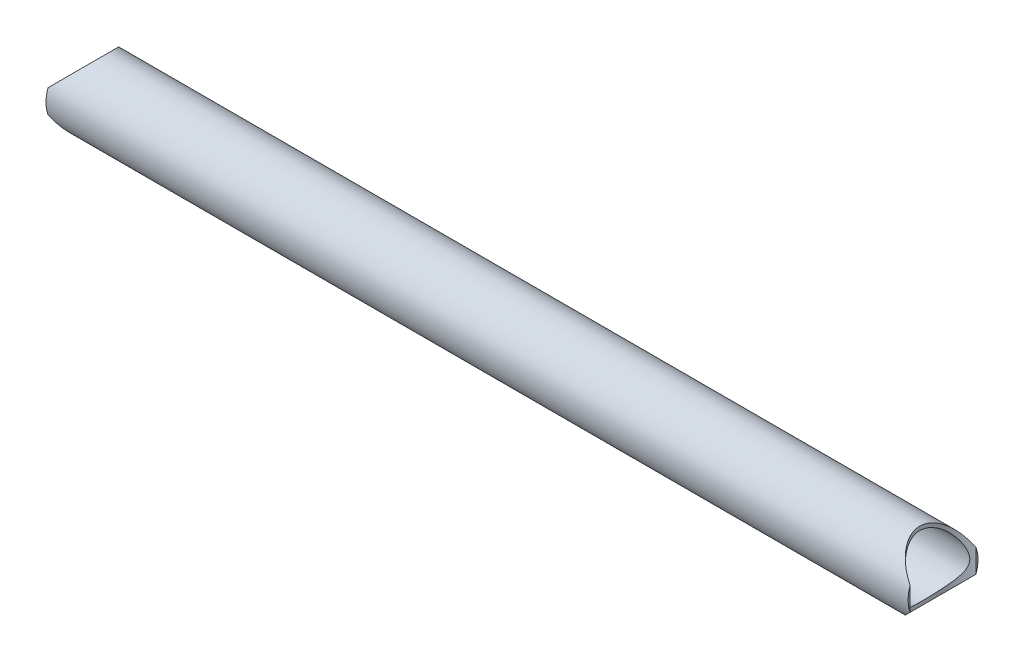
ISO-10303-21;
HEADER;
FILE_DESCRIPTION(('STEP AP214'),'2;1');
FILE_NAME('part.step','',(''),(''),'','','');
FILE_SCHEMA(('AUTOMOTIVE_DESIGN { 1 0 10303 214 1 1 1 1 }'));
ENDSEC;
DATA;
#1=APPLICATION_CONTEXT('core data for automotive mechanical design processes');
#2=APPLICATION_PROTOCOL_DEFINITION('international standard','automotive_design',2000,#1);
#3=PRODUCT_CONTEXT('',#1,'mechanical');
#4=PRODUCT('Part','Part','',(#3));
#5=PRODUCT_RELATED_PRODUCT_CATEGORY('part','',(#4));
#6=PRODUCT_DEFINITION_FORMATION('','',#4);
#7=PRODUCT_DEFINITION_CONTEXT('part definition',#1,'design');
#8=PRODUCT_DEFINITION('design','',#6,#7);
#9=PRODUCT_DEFINITION_SHAPE('','',#8);
#10=(LENGTH_UNIT() NAMED_UNIT(*) SI_UNIT(.MILLI.,.METRE.));
#11=(NAMED_UNIT(*) PLANE_ANGLE_UNIT() SI_UNIT($,.RADIAN.));
#12=(NAMED_UNIT(*) SI_UNIT($,.STERADIAN.) SOLID_ANGLE_UNIT());
#13=UNCERTAINTY_MEASURE_WITH_UNIT(LENGTH_MEASURE(1.E-05),#10,'distance_accuracy_value','');
#14=(GEOMETRIC_REPRESENTATION_CONTEXT(3) GLOBAL_UNCERTAINTY_ASSIGNED_CONTEXT((#13)) GLOBAL_UNIT_ASSIGNED_CONTEXT((#10,
#11,#12)) REPRESENTATION_CONTEXT('',''));
#15=CARTESIAN_POINT('',(0.,0.,0.));
#16=DIRECTION('',(0.,0.,1.));
#17=DIRECTION('',(1.,0.,0.));
#18=AXIS2_PLACEMENT_3D('',#15,#16,#17);
#19=CARTESIAN_POINT('',(469.9,0.,0.));
#20=DIRECTION('',(1.,0.,0.));
#21=DIRECTION('',(0.,0.,-1.));
#22=AXIS2_PLACEMENT_3D('',#19,#20,#21);
#23=PLANE('',#22);
#24=CARTESIAN_POINT('',(469.9,0.,0.));
#25=DIRECTION('',(1.,0.,0.));
#26=DIRECTION('',(0.,0.,-1.));
#27=AXIS2_PLACEMENT_3D('',#24,#25,#26);
#28=CIRCLE('',#27,19.05);
#29=CARTESIAN_POINT('',(469.9,6.35000000000022,-17.9605122421382));
#30=VERTEX_POINT('',#29);
#31=CARTESIAN_POINT('',(469.9,-6.35000000000023,-17.9605122421382));
#32=VERTEX_POINT('',#31);
#33=EDGE_CURVE('E68',#30,#32,#28,.F.);
#34=ORIENTED_EDGE('',*,*,#33,.F.);
#35=DIRECTION('',(0.,1.,0.));
#36=VECTOR('',#35,1.);
#37=CARTESIAN_POINT('',(469.9,-59.1185,-17.9605122421382));
#38=LINE('',#37,#36);
#39=EDGE_CURVE('E73',#30,#32,#38,.F.);
#40=ORIENTED_EDGE('',*,*,#39,.T.);
#41=EDGE_LOOP('',(#34,#40));
#42=FACE_BOUND('',#41,.T.);
#43=ADVANCED_FACE('F17',(#42),#23,.T.);
#44=CARTESIAN_POINT('',(0.,0.,0.));
#45=DIRECTION('',(1.,0.,0.));
#46=DIRECTION('',(0.,0.,-1.));
#47=AXIS2_PLACEMENT_3D('',#44,#45,#46);
#48=PLANE('',#47);
#49=DIRECTION('',(0.,1.,0.));
#50=VECTOR('',#49,1.);
#51=CARTESIAN_POINT('',(3.81639164714898E-13,-59.1185,-17.9605122421382));
#52=LINE('',#51,#50);
#53=CARTESIAN_POINT('',(1.91036422791946E-13,-6.35000000000019,-17.9605122421382));
#54=VERTEX_POINT('',#53);
#55=CARTESIAN_POINT('',(1.91036422791946E-13,6.35000000000019,-17.9605122421382));
#56=VERTEX_POINT('',#55);
#57=EDGE_CURVE('E89',#54,#56,#52,.T.);
#58=ORIENTED_EDGE('',*,*,#57,.T.);
#59=CARTESIAN_POINT('',(0.,0.,0.));
#60=DIRECTION('',(1.,0.,0.));
#61=DIRECTION('',(0.,0.,-1.));
#62=AXIS2_PLACEMENT_3D('',#59,#60,#61);
#63=CIRCLE('',#62,19.05);
#64=EDGE_CURVE('E78',#54,#56,#63,.T.);
#65=ORIENTED_EDGE('',*,*,#64,.F.);
#66=EDGE_LOOP('',(#58,#65));
#67=FACE_BOUND('',#66,.T.);
#68=ADVANCED_FACE('F112',(#67),#48,.F.);
#69=CARTESIAN_POINT('',(0.,0.,0.));
#70=DIRECTION('',(1.,0.,0.));
#71=DIRECTION('',(0.,0.,-1.));
#72=AXIS2_PLACEMENT_3D('',#69,#70,#71);
#73=CYLINDRICAL_SURFACE('',#72,16.9418);
#74=CARTESIAN_POINT('',(457.2,16.9418,0.));
#75=CARTESIAN_POINT('',(457.20000374405,16.9417961923884,0.394184193497354));
#76=CARTESIAN_POINT('',(457.212262153139,16.9280155894072,0.788435535775757));
#77=CARTESIAN_POINT('',(457.261024211929,16.8731574498692,1.57356577010718));
#78=CARTESIAN_POINT('',(457.297533436322,16.8320736369451,1.96444386579684));
#79=CARTESIAN_POINT('',(457.394014592432,16.7233639167852,2.73991152674503));
#80=CARTESIAN_POINT('',(457.454008108813,16.6557135918004,3.1244949667674));
#81=CARTESIAN_POINT('',(457.596166269736,16.4951203047581,3.88411123711813));
#82=CARTESIAN_POINT('',(457.678330169879,16.4021781919052,4.25914438764759));
#83=CARTESIAN_POINT('',(457.862598152288,16.1932406328883,4.99488319536369));
#84=CARTESIAN_POINT('',(457.964569298355,16.0773987911132,5.35566607021391));
#85=CARTESIAN_POINT('',(458.18697357334,15.8239912188579,6.06360117385424));
#86=CARTESIAN_POINT('',(458.307406460062,15.6864257733653,6.41075358138511));
#87=CARTESIAN_POINT('',(458.564834278465,15.3913086823074,7.09008972801092));
#88=CARTESIAN_POINT('',(458.701830369669,15.2337556374548,7.42227241690057));
#89=CARTESIAN_POINT('',(458.990464241844,14.9003563184219,8.07074683742289));
#90=CARTESIAN_POINT('',(459.142105284976,14.7245059678419,8.38703500458892));
#91=CARTESIAN_POINT('',(459.520217204701,14.2837373054012,9.12410505100005));
#92=CARTESIAN_POINT('',(459.752687093087,14.0109622384892,9.53714057189235));
#93=CARTESIAN_POINT('',(460.237460743635,13.4367851491422,10.3304086586787));
#94=CARTESIAN_POINT('',(460.489771716018,13.1353727115659,10.7106291933897));
#95=CARTESIAN_POINT('',(461.010097116028,12.5063214936941,11.4389050770027));
#96=CARTESIAN_POINT('',(461.278144951756,12.1786263348985,11.7868876327893));
#97=CARTESIAN_POINT('',(461.824845762738,11.499897771744,12.4499819069018));
#98=CARTESIAN_POINT('',(462.103497327648,11.1488674664611,12.7650979759111));
#99=CARTESIAN_POINT('',(462.673194169387,10.4166191913228,13.3697111612046));
#100=CARTESIAN_POINT('',(462.964377220476,10.034898304148,13.6584684285955));
#101=CARTESIAN_POINT('',(463.547673625015,9.24882151979436,14.2025527079429));
#102=CARTESIAN_POINT('',(463.839787225436,8.84445904128633,14.4578699269681));
#103=CARTESIAN_POINT('',(464.417840094133,8.01320927376596,14.9346013590283));
#104=CARTESIAN_POINT('',(464.703789755916,7.58636490171245,15.1560772296062));
#105=CARTESIAN_POINT('',(465.121695004004,6.92746866843016,15.4626419512512));
#106=CARTESIAN_POINT('',(465.259134561576,6.70477675080936,15.5605388024915));
#107=CARTESIAN_POINT('',(465.528904063937,6.25275448249376,15.7476188132693));
#108=CARTESIAN_POINT('',(465.661234784508,6.02342514902508,15.8368032989616));
#109=CARTESIAN_POINT('',(465.920396494113,5.5552838813426,16.0070634993151));
#110=CARTESIAN_POINT('',(466.047156460578,5.31639841182006,16.088045825461));
#111=CARTESIAN_POINT('',(466.291456023067,4.83100990439237,16.2404006796485));
#112=CARTESIAN_POINT('',(466.408997959897,4.58450882268691,16.3117756506805));
#113=CARTESIAN_POINT('',(466.632080889626,4.08370675821869,16.4442984069774));
#114=CARTESIAN_POINT('',(466.737633328698,3.82941351414151,16.5054559733479));
#115=CARTESIAN_POINT('',(466.933627012263,3.31270004661861,16.6168712827558));
#116=CARTESIAN_POINT('',(467.024070755538,3.05028117557335,16.6671308285956));
#117=CARTESIAN_POINT('',(467.172853996104,2.56155126793313,16.7485490492217));
#118=CARTESIAN_POINT('',(467.234027358225,2.33640475862085,16.7814899418482));
#119=CARTESIAN_POINT('',(467.341080238411,1.88142840856819,16.8385670532647));
#120=CARTESIAN_POINT('',(467.386964442065,1.65160002561207,16.8627059697651));
#121=CARTESIAN_POINT('',(467.46142642816,1.18876159210725,16.9016346143041));
#122=CARTESIAN_POINT('',(467.490035117052,0.955757990655721,16.9164410405595));
#123=CARTESIAN_POINT('',(467.528675593239,0.487787683136417,16.9363952490215));
#124=CARTESIAN_POINT('',(467.538708023371,0.252821045282685,16.9415433654564));
#125=CARTESIAN_POINT('',(467.539671046546,-0.217818078177486,16.9420385610885));
#126=CARTESIAN_POINT('',(467.530548328064,-0.45349070601054,16.9373582864601));
#127=CARTESIAN_POINT('',(467.493575971063,-0.922946866189683,16.9182729817827));
#128=CARTESIAN_POINT('',(467.465725790753,-1.15673034368411,16.9038676703857));
#129=CARTESIAN_POINT('',(467.39261073801,-1.62115360877383,16.8656705247631));
#130=CARTESIAN_POINT('',(467.347316267991,-1.85178735983585,16.8418627356726));
#131=CARTESIAN_POINT('',(467.241268999413,-2.30839613187296,16.7853765549414));
#132=CARTESIAN_POINT('',(467.180510348983,-2.53436935416423,16.7526948049513));
#133=CARTESIAN_POINT('',(467.011317887817,-3.0949587905454,16.6602122327194));
#134=CARTESIAN_POINT('',(466.894381527947,-3.42613532293257,16.5950848859265));
#135=CARTESIAN_POINT('',(466.637584269334,-4.07550920863551,16.4476704242981));
#136=CARTESIAN_POINT('',(466.497709104086,-4.39369832980286,16.3653726217851));
#137=CARTESIAN_POINT('',(466.200719694186,-5.01855813637698,16.1847084588515));
#138=CARTESIAN_POINT('',(466.043546861256,-5.32518463905187,16.0862869000011));
#139=CARTESIAN_POINT('',(465.717258231689,-5.92659541327609,15.8745609394275));
#140=CARTESIAN_POINT('',(465.548143533768,-6.22138077036862,15.7612579060561));
#141=CARTESIAN_POINT('',(465.223468669035,-6.76368935777249,15.5355128442468));
#142=CARTESIAN_POINT('',(465.068874817248,-7.01249751499682,15.4247509464399));
#143=CARTESIAN_POINT('',(464.755349492994,-7.5022932883897,15.1925513006733));
#144=CARTESIAN_POINT('',(464.596417447248,-7.74327986165949,15.0711121369911));
#145=CARTESIAN_POINT('',(464.115443368151,-8.45533714282104,14.6908757746471));
#146=CARTESIAN_POINT('',(463.789334858791,-8.91532399132141,14.4162357153203));
#147=CARTESIAN_POINT('',(463.136691494802,-9.80676129687201,13.8252563067096));
#148=CARTESIAN_POINT('',(462.810156916591,-10.2382252174247,13.5089368452219));
#149=CARTESIAN_POINT('',(462.16432323517,-11.0723963580603,12.8341031687215));
#150=CARTESIAN_POINT('',(461.845021008555,-11.4751161598644,12.4756075990565));
#151=CARTESIAN_POINT('',(461.279484484933,-12.1767333021638,11.7875104078084));
#152=CARTESIAN_POINT('',(461.030835679443,-12.4808781654303,11.4652302076634));
#153=CARTESIAN_POINT('',(460.546387585142,-13.0672425088248,10.7921703362534));
#154=CARTESIAN_POINT('',(460.310588584201,-13.3494614978141,10.4413900269468));
#155=CARTESIAN_POINT('',(459.855918358068,-13.8891714046938,9.7119031779547));
#156=CARTESIAN_POINT('',(459.637023484663,-14.146696994291,9.33323715426068));
#157=CARTESIAN_POINT('',(459.219721476738,-14.6344940609238,8.54807684872156));
#158=CARTESIAN_POINT('',(459.021308974995,-14.8647726801095,8.14158990376795));
#159=CARTESIAN_POINT('',(458.688182123013,-15.2494827529787,7.39030570283803));
#160=CARTESIAN_POINT('',(458.548845147345,-15.4096825772221,7.05050184258115));
#161=CARTESIAN_POINT('',(458.287548692147,-15.7091405581432,6.35536238395083));
#162=CARTESIAN_POINT('',(458.165585484047,-15.8484032084881,6.00003013956724));
#163=CARTESIAN_POINT('',(457.941184083557,-16.1039921676819,5.27573053950246));
#164=CARTESIAN_POINT('',(457.838722110629,-16.2203464179418,4.90678045432038));
#165=CARTESIAN_POINT('',(457.655060307867,-16.4285201572901,4.15687556096404));
#166=CARTESIAN_POINT('',(457.573855421012,-16.5203454818711,3.77592363221096));
#167=CARTESIAN_POINT('',(457.454213596944,-16.6554600945729,3.11441535552881));
#168=CARTESIAN_POINT('',(457.410182409363,-16.7051249938061,2.83614726285122));
#169=CARTESIAN_POINT('',(457.334322860884,-16.7906319202838,2.2758599476137));
#170=CARTESIAN_POINT('',(457.302493065463,-16.8264755725,1.99384117005952));
#171=CARTESIAN_POINT('',(457.25140252241,-16.8839855488843,1.42714698383879));
#172=CARTESIAN_POINT('',(457.232145187254,-16.9056480239346,1.14247087515575));
#173=CARTESIAN_POINT('',(457.206443660979,-16.9345554007589,0.571874809772043));
#174=CARTESIAN_POINT('',(457.199997283934,-16.9418027621753,0.285955073616249));
#175=CARTESIAN_POINT('',(457.20000374405,-16.9417961923884,-0.39418419349736));
#176=CARTESIAN_POINT('',(457.212262153139,-16.9280155894072,-0.788435535775764));
#177=CARTESIAN_POINT('',(457.261024211929,-16.8731574498691,-1.57356577010719));
#178=CARTESIAN_POINT('',(457.297533436322,-16.8320736369451,-1.96444386579685));
#179=CARTESIAN_POINT('',(457.394014592432,-16.7233639167852,-2.73991152674504));
#180=CARTESIAN_POINT('',(457.454008108813,-16.6557135918004,-3.12449496676741));
#181=CARTESIAN_POINT('',(457.596166269736,-16.4951203047581,-3.88411123711814));
#182=CARTESIAN_POINT('',(457.678330169879,-16.4021781919052,-4.25914438764759));
#183=CARTESIAN_POINT('',(457.862598152288,-16.1932406328883,-4.9948831953637));
#184=CARTESIAN_POINT('',(457.964569298355,-16.0773987911132,-5.35566607021392));
#185=CARTESIAN_POINT('',(458.18697357334,-15.8239912188579,-6.06360117385424));
#186=CARTESIAN_POINT('',(458.307406460062,-15.6864257733653,-6.41075358138511));
#187=CARTESIAN_POINT('',(458.564834278466,-15.3913086823074,-7.09008972801092));
#188=CARTESIAN_POINT('',(458.701830369669,-15.2337556374548,-7.42227241690057));
#189=CARTESIAN_POINT('',(458.990464241844,-14.9003563184219,-8.0707468374229));
#190=CARTESIAN_POINT('',(459.142105284976,-14.7245059678419,-8.38703500458892));
#191=CARTESIAN_POINT('',(459.520217204701,-14.2837373054012,-9.12410505100006));
#192=CARTESIAN_POINT('',(459.752687093087,-14.0109622384892,-9.53714057189237));
#193=CARTESIAN_POINT('',(460.237460743635,-13.4367851491422,-10.3304086586788));
#194=CARTESIAN_POINT('',(460.489771716018,-13.1353727115659,-10.7106291933897));
#195=CARTESIAN_POINT('',(461.010097116028,-12.5063214936941,-11.4389050770027));
#196=CARTESIAN_POINT('',(461.278144951756,-12.1786263348985,-11.7868876327893));
#197=CARTESIAN_POINT('',(461.824845762738,-11.499897771744,-12.4499819069018));
#198=CARTESIAN_POINT('',(462.103497327648,-11.1488674664611,-12.7650979759111));
#199=CARTESIAN_POINT('',(462.673194169387,-10.4166191913228,-13.3697111612046));
#200=CARTESIAN_POINT('',(462.964377220476,-10.034898304148,-13.6584684285955));
#201=CARTESIAN_POINT('',(463.547673625015,-9.24882151979436,-14.2025527079429));
#202=CARTESIAN_POINT('',(463.839787225436,-8.84445904128632,-14.4578699269681));
#203=CARTESIAN_POINT('',(464.417840094133,-8.01320927376596,-14.9346013590283));
#204=CARTESIAN_POINT('',(464.703789755917,-7.58636490171246,-15.1560772296061));
#205=CARTESIAN_POINT('',(465.121695004004,-6.92746866843016,-15.4626419512512));
#206=CARTESIAN_POINT('',(465.259134561576,-6.70477675080936,-15.5605388024915));
#207=CARTESIAN_POINT('',(465.528904063937,-6.25275448249375,-15.7476188132693));
#208=CARTESIAN_POINT('',(465.661234784508,-6.02342514902508,-15.8368032989616));
#209=CARTESIAN_POINT('',(465.920396494113,-5.5552838813426,-16.0070634993151));
#210=CARTESIAN_POINT('',(466.047156460578,-5.31639841182006,-16.088045825461));
#211=CARTESIAN_POINT('',(466.291456023067,-4.83100990439235,-16.2404006796486));
#212=CARTESIAN_POINT('',(466.408997959897,-4.58450882268688,-16.3117756506805));
#213=CARTESIAN_POINT('',(466.632080889626,-4.08370675821868,-16.4442984069774));
#214=CARTESIAN_POINT('',(466.737633328698,-3.8294135141415,-16.5054559733479));
#215=CARTESIAN_POINT('',(466.933627012263,-3.31270004661861,-16.6168712827558));
#216=CARTESIAN_POINT('',(467.024070755538,-3.05028117557335,-16.6671308285956));
#217=CARTESIAN_POINT('',(467.172853996104,-2.56155126793313,-16.7485490492217));
#218=CARTESIAN_POINT('',(467.234027358225,-2.33640475862086,-16.7814899418482));
#219=CARTESIAN_POINT('',(467.341080238411,-1.8814284085682,-16.8385670532647));
#220=CARTESIAN_POINT('',(467.386964442065,-1.65160002561207,-16.8627059697651));
#221=CARTESIAN_POINT('',(467.46142642816,-1.18876159210724,-16.9016346143041));
#222=CARTESIAN_POINT('',(467.490035117052,-0.955757990655717,-16.9164410405595));
#223=CARTESIAN_POINT('',(467.528675593239,-0.487787683136415,-16.9363952490215));
#224=CARTESIAN_POINT('',(467.538708023371,-0.252821045282685,-16.9415433654564));
#225=CARTESIAN_POINT('',(467.539671046546,0.217818078177486,-16.9420385610885));
#226=CARTESIAN_POINT('',(467.530548328064,0.45349070601054,-16.9373582864601));
#227=CARTESIAN_POINT('',(467.493575971063,0.922946866189683,-16.9182729817827));
#228=CARTESIAN_POINT('',(467.465725790753,1.15673034368411,-16.9038676703857));
#229=CARTESIAN_POINT('',(467.39261073801,1.62115360877383,-16.8656705247631));
#230=CARTESIAN_POINT('',(467.347316267991,1.85178735983586,-16.8418627356726));
#231=CARTESIAN_POINT('',(467.241268999413,2.30839613187296,-16.7853765549414));
#232=CARTESIAN_POINT('',(467.180510348983,2.53436935416423,-16.7526948049513));
#233=CARTESIAN_POINT('',(467.011317887817,3.0949587905454,-16.6602122327194));
#234=CARTESIAN_POINT('',(466.894381527947,3.42613532293256,-16.5950848859265));
#235=CARTESIAN_POINT('',(466.637584269334,4.07550920863551,-16.4476704242981));
#236=CARTESIAN_POINT('',(466.497709104086,4.39369832980285,-16.3653726217851));
#237=CARTESIAN_POINT('',(466.200719694186,5.01855813637697,-16.1847084588516));
#238=CARTESIAN_POINT('',(466.043546861256,5.32518463905186,-16.0862869000011));
#239=CARTESIAN_POINT('',(465.717258231689,5.92659541327609,-15.8745609394275));
#240=CARTESIAN_POINT('',(465.548143533768,6.22138077036862,-15.7612579060561));
#241=CARTESIAN_POINT('',(465.223468669035,6.76368935777248,-15.5355128442468));
#242=CARTESIAN_POINT('',(465.068874817248,7.0124975149968,-15.4247509464399));
#243=CARTESIAN_POINT('',(464.755349492994,7.50229328838968,-15.1925513006733));
#244=CARTESIAN_POINT('',(464.596417447248,7.74327986165948,-15.0711121369911));
#245=CARTESIAN_POINT('',(464.115443368151,8.45533714282105,-14.6908757746471));
#246=CARTESIAN_POINT('',(463.789334858791,8.91532399132141,-14.4162357153203));
#247=CARTESIAN_POINT('',(463.136691494802,9.80676129687201,-13.8252563067096));
#248=CARTESIAN_POINT('',(462.810156916591,10.2382252174247,-13.5089368452219));
#249=CARTESIAN_POINT('',(462.16432323517,11.0723963580603,-12.8341031687215));
#250=CARTESIAN_POINT('',(461.845021008555,11.4751161598644,-12.4756075990565));
#251=CARTESIAN_POINT('',(461.279484484933,12.1767333021638,-11.7875104078084));
#252=CARTESIAN_POINT('',(461.030835679443,12.4808781654303,-11.4652302076634));
#253=CARTESIAN_POINT('',(460.546387585142,13.0672425088248,-10.7921703362535));
#254=CARTESIAN_POINT('',(460.310588584201,13.3494614978141,-10.4413900269468));
#255=CARTESIAN_POINT('',(459.855918358068,13.8891714046938,-9.7119031779547));
#256=CARTESIAN_POINT('',(459.637023484663,14.146696994291,-9.33323715426068));
#257=CARTESIAN_POINT('',(459.219721476738,14.6344940609238,-8.54807684872157));
#258=CARTESIAN_POINT('',(459.021308974995,14.8647726801095,-8.14158990376795));
#259=CARTESIAN_POINT('',(458.688182123013,15.2494827529787,-7.39030570283804));
#260=CARTESIAN_POINT('',(458.548845147345,15.4096825772221,-7.05050184258116));
#261=CARTESIAN_POINT('',(458.287548692147,15.7091405581432,-6.35536238395084));
#262=CARTESIAN_POINT('',(458.165585484047,15.8484032084881,-6.00003013956727));
#263=CARTESIAN_POINT('',(457.941184083557,16.1039921676819,-5.27573053950248));
#264=CARTESIAN_POINT('',(457.838722110629,16.2203464179418,-4.9067804543204));
#265=CARTESIAN_POINT('',(457.655060307867,16.4285201572901,-4.15687556096405));
#266=CARTESIAN_POINT('',(457.573855421012,16.5203454818711,-3.77592363221097));
#267=CARTESIAN_POINT('',(457.454213596944,16.6554600945729,-3.11441535552881));
#268=CARTESIAN_POINT('',(457.410182409363,16.7051249938061,-2.83614726285123));
#269=CARTESIAN_POINT('',(457.334322860884,16.7906319202838,-2.27585994761371));
#270=CARTESIAN_POINT('',(457.302493065463,16.8264755725,-1.99384117005953));
#271=CARTESIAN_POINT('',(457.25140252241,16.8839855488843,-1.4271469838388));
#272=CARTESIAN_POINT('',(457.232145187254,16.9056480239346,-1.14247087515575));
#273=CARTESIAN_POINT('',(457.206443660979,16.9345554007589,-0.571874809772045));
#274=CARTESIAN_POINT('',(457.199997283934,16.9418027621753,-0.285955073616253));
#275=CARTESIAN_POINT('',(457.2,16.9418,0.));
#276=B_SPLINE_CURVE_WITH_KNOTS('',3,(#74,#75,#76,#77,#78,#79,#80,#81,#82,#83,#84,#85,#86,#87,
#88,#89,#90,#91,#92,#93,#94,#95,#96,#97,#98,#99,#100,#101,#102,#103,#104,#105,#106,#107,#108,
#109,#110,#111,#112,#113,#114,#115,#116,#117,#118,#119,#120,#121,#122,#123,#124,#125,#126,#127,
#128,#129,#130,#131,#132,#133,#134,#135,#136,#137,#138,#139,#140,#141,#142,#143,#144,#145,#146,
#147,#148,#149,#150,#151,#152,#153,#154,#155,#156,#157,#158,#159,#160,#161,#162,#163,#164,#165,
#166,#167,#168,#169,#170,#171,#172,#173,#174,#175,#176,#177,#178,#179,#180,#181,#182,#183,#184,
#185,#186,#187,#188,#189,#190,#191,#192,#193,#194,#195,#196,#197,#198,#199,#200,#201,#202,#203,
#204,#205,#206,#207,#208,#209,#210,#211,#212,#213,#214,#215,#216,#217,#218,#219,#220,#221,#222,
#223,#224,#225,#226,#227,#228,#229,#230,#231,#232,#233,#234,#235,#236,#237,#238,#239,#240,#241,
#242,#243,#244,#245,#246,#247,#248,#249,#250,#251,#252,#253,#254,#255,#256,#257,#258,#259,#260,
#261,#262,#263,#264,#265,#266,#267,#268,#269,#270,#271,#272,#273,#274,#275),.UNSPECIFIED.,.T.,
.F.,(4,2,2,2,2,2,2,2,2,2,2,2,2,2,2,2,2,2,2,2,2,2,2,2,2,2,2,2,2,2,2,2,2,2,2,2,2,2,2,2,2,2,2,2,2,
2,2,2,2,2,2,2,2,2,2,2,2,2,2,2,2,2,2,2,2,2,2,2,2,2,2,2,2,2,2,2,2,2,2,2,2,2,2,2,2,2,2,2,2,2,2,2,2,
2,2,2,2,2,2,2,4),(0.,1.182242256413,2.36475637661828,3.54835991978547,4.73192372682959,
5.90780261774796,7.08366608382876,8.25961191496236,9.43582029464446,11.0739682017032,
12.7127141850546,14.3550745833379,15.997217298389,17.6764688085164,19.3562109937498,
21.0328552979581,21.8708516620749,22.7087202709684,23.5552531660917,24.401570393718,
25.2470727422877,26.0924351169491,26.7986824529679,27.5047131495125,28.2094769630755,
28.9142163876493,29.6209198025279,30.3276436634078,31.0355719374648,31.7437685012011,
32.8135631624545,33.8840257101524,34.9582325707478,36.0323407270626,36.9715067853865,
37.9107975581714,39.7900551537562,41.6684192659187,43.5459560833924,45.0690515735913,
46.5921811712461,48.1131398453261,49.6336989485931,50.8346318927197,52.035306716025,
53.234507876433,54.4334234892966,55.2910781673585,56.148631979721,57.0064184567369,
57.8640585575876,59.0463008140006,60.2288149342059,61.4124184773731,62.5959822844172,
63.7718611753356,64.9477246414164,66.12367047255,67.2998788522321,68.9380267592908,
70.5767727426422,72.2191331409256,73.8612758559766,75.540527366104,77.2202695513374,
78.8969138555458,79.7349102196625,80.572778828556,81.4193117236794,82.2656289513056,
83.1111312998754,83.9564936745367,84.6627410105555,85.3687717071002,86.0735355206631,
86.7782749452369,87.4849783601155,88.1917022209954,88.8996304950525,89.6078270587887,
90.6776217200421,91.74808426774,92.8222911283354,93.8963992846502,94.8355653429741,
95.7748561157591,97.6541137113438,99.5324778235064,101.41001464098,102.933110131179,
104.456239728834,105.977198402914,107.497757506181,108.698690450307,109.899365273613,
111.098566434021,112.297482046884,113.155136724946,114.012690537309,114.870477014325,
115.728117115175),.UNSPECIFIED.);
#277=CARTESIAN_POINT('',(457.2,16.9418,0.));
#278=VERTEX_POINT('',#277);
#279=EDGE_CURVE('E20',#278,#278,#276,.T.);
#280=ORIENTED_EDGE('',*,*,#279,.T.);
#281=EDGE_LOOP('',(#280));
#282=FACE_BOUND('',#281,.T.);
#283=CARTESIAN_POINT('',(12.7,-16.9418,0.));
#284=CARTESIAN_POINT('',(12.6999962559498,-16.9417961923884,0.394184193497359));
#285=CARTESIAN_POINT('',(12.6877378468611,-16.9280155894072,0.788435535775762));
#286=CARTESIAN_POINT('',(12.6389757880712,-16.8731574498691,1.57356577010719));
#287=CARTESIAN_POINT('',(12.6024665636778,-16.8320736369451,1.96444386579685));
#288=CARTESIAN_POINT('',(12.5059854075676,-16.7233639167852,2.73991152674503));
#289=CARTESIAN_POINT('',(12.4459918911874,-16.6557135918004,3.1244949667674));
#290=CARTESIAN_POINT('',(12.3038337302642,-16.4951203047581,3.88411123711813));
#291=CARTESIAN_POINT('',(12.2216698301213,-16.4021781919052,4.25914438764759));
#292=CARTESIAN_POINT('',(12.0374018477123,-16.1932406328883,4.9948831953637));
#293=CARTESIAN_POINT('',(11.9354307016452,-16.0773987911132,5.35566607021391));
#294=CARTESIAN_POINT('',(11.7130264266601,-15.8239912188579,6.06360117385423));
#295=CARTESIAN_POINT('',(11.5925935399384,-15.6864257733653,6.41075358138511));
#296=CARTESIAN_POINT('',(11.3351657215345,-15.3913086823074,7.09008972801091));
#297=CARTESIAN_POINT('',(11.1981696303309,-15.2337556374548,7.42227241690056));
#298=CARTESIAN_POINT('',(10.9095357581561,-14.9003563184219,8.07074683742288));
#299=CARTESIAN_POINT('',(10.7578947150245,-14.7245059678419,8.38703500458892));
#300=CARTESIAN_POINT('',(10.379782795299,-14.2837373054012,9.12410505100006));
#301=CARTESIAN_POINT('',(10.1473129069134,-14.0109622384892,9.53714057189237));
#302=CARTESIAN_POINT('',(9.66253925636533,-13.4367851491422,10.3304086586788));
#303=CARTESIAN_POINT('',(9.41022828398154,-13.1353727115659,10.7106291933897));
#304=CARTESIAN_POINT('',(8.889902883972,-12.5063214936942,11.4389050770027));
#305=CARTESIAN_POINT('',(8.62185504824389,-12.1786263348985,11.7868876327893));
#306=CARTESIAN_POINT('',(8.07515423726156,-11.499897771744,12.4499819069018));
#307=CARTESIAN_POINT('',(7.7965026723524,-11.1488674664611,12.7650979759111));
#308=CARTESIAN_POINT('',(7.22680583061332,-10.4166191913228,13.3697111612046));
#309=CARTESIAN_POINT('',(6.93562277952356,-10.034898304148,13.6584684285955));
#310=CARTESIAN_POINT('',(6.35232637498465,-9.24882151979435,14.2025527079429));
#311=CARTESIAN_POINT('',(6.0602127745636,-8.84445904128632,14.4578699269681));
#312=CARTESIAN_POINT('',(5.48215990586723,-8.01320927376596,14.9346013590283));
#313=CARTESIAN_POINT('',(5.19621024408353,-7.58636490171244,15.1560772296062));
#314=CARTESIAN_POINT('',(4.77830499599579,-6.92746866843015,15.4626419512512));
#315=CARTESIAN_POINT('',(4.6408654384238,-6.70477675080936,15.5605388024915));
#316=CARTESIAN_POINT('',(4.37109593606302,-6.25275448249376,15.7476188132693));
#317=CARTESIAN_POINT('',(4.23876521549179,-6.02342514902508,15.8368032989616));
#318=CARTESIAN_POINT('',(3.97960350588743,-5.5552838813426,16.0070634993151));
#319=CARTESIAN_POINT('',(3.85284353942187,-5.31639841182006,16.088045825461));
#320=CARTESIAN_POINT('',(3.60854397693291,-4.83100990439237,16.2404006796485));
#321=CARTESIAN_POINT('',(3.49100204010332,-4.5845088226869,16.3117756506805));
#322=CARTESIAN_POINT('',(3.26791911037427,-4.08370675821868,16.4442984069774));
#323=CARTESIAN_POINT('',(3.16236667130175,-3.8294135141415,16.5054559733479));
#324=CARTESIAN_POINT('',(2.96637298773714,-3.3127000466186,16.6168712827558));
#325=CARTESIAN_POINT('',(2.87592924446191,-3.05028117557334,16.6671308285956));
#326=CARTESIAN_POINT('',(2.72714600389564,-2.56155126793312,16.7485490492217));
#327=CARTESIAN_POINT('',(2.66597264177484,-2.33640475862084,16.7814899418482));
#328=CARTESIAN_POINT('',(2.55891976158907,-1.88142840856819,16.8385670532647));
#329=CARTESIAN_POINT('',(2.51303555793454,-1.65160002561206,16.8627059697651));
#330=CARTESIAN_POINT('',(2.43857357184005,-1.18876159210724,16.9016346143041));
#331=CARTESIAN_POINT('',(2.40996488294827,-0.955757990655716,16.9164410405595));
#332=CARTESIAN_POINT('',(2.37132440676107,-0.487787683136411,16.9363952490215));
#333=CARTESIAN_POINT('',(2.36129197662944,-0.252821045282679,16.9415433654564));
#334=CARTESIAN_POINT('',(2.36032895345432,0.217818078177492,16.9420385610885));
#335=CARTESIAN_POINT('',(2.36945167193583,0.453490706010545,16.9373582864601));
#336=CARTESIAN_POINT('',(2.40642402893692,0.922946866189686,16.9182729817827));
#337=CARTESIAN_POINT('',(2.43427420924705,1.15673034368411,16.9038676703857));
#338=CARTESIAN_POINT('',(2.50738926199041,1.62115360877383,16.8656705247631));
#339=CARTESIAN_POINT('',(2.55268373200899,1.85178735983585,16.8418627356726));
#340=CARTESIAN_POINT('',(2.65873100058688,2.30839613187296,16.7853765549414));
#341=CARTESIAN_POINT('',(2.71948965101677,2.53436935416423,16.7526948049513));
#342=CARTESIAN_POINT('',(2.88868211218302,3.0949587905454,16.6602122327194));
#343=CARTESIAN_POINT('',(3.00561847205266,3.42613532293257,16.5950848859265));
#344=CARTESIAN_POINT('',(3.26241573066607,4.07550920863551,16.4476704242981));
#345=CARTESIAN_POINT('',(3.40229089591383,4.39369832980286,16.3653726217851));
#346=CARTESIAN_POINT('',(3.69928030581351,5.01855813637698,16.1847084588515));
#347=CARTESIAN_POINT('',(3.85645313874429,5.32518463905188,16.0862869000011));
#348=CARTESIAN_POINT('',(4.18274176831084,5.9265954132761,15.8745609394275));
#349=CARTESIAN_POINT('',(4.35185646623168,6.22138077036862,15.7612579060561));
#350=CARTESIAN_POINT('',(4.67653133096483,6.7636893577725,15.5355128442468));
#351=CARTESIAN_POINT('',(4.83112518275186,7.01249751499683,15.4247509464399));
#352=CARTESIAN_POINT('',(5.144650507006,7.5022932883897,15.1925513006733));
#353=CARTESIAN_POINT('',(5.30358255275168,7.74327986165949,15.0711121369911));
#354=CARTESIAN_POINT('',(5.78455663184951,8.45533714282104,14.6908757746471));
#355=CARTESIAN_POINT('',(6.11066514120858,8.91532399132142,14.4162357153203));
#356=CARTESIAN_POINT('',(6.76330850519844,9.80676129687203,13.8252563067096));
#357=CARTESIAN_POINT('',(7.08984308340941,10.2382252174247,13.5089368452219));
#358=CARTESIAN_POINT('',(7.73567676483025,11.0723963580603,12.8341031687214));
#359=CARTESIAN_POINT('',(8.05497899144475,11.4751161598644,12.4756075990565));
#360=CARTESIAN_POINT('',(8.6205155150666,12.1767333021639,11.7875104078083));
#361=CARTESIAN_POINT('',(8.86916432055683,12.4808781654303,11.4652302076634));
#362=CARTESIAN_POINT('',(9.35361241485807,13.0672425088249,10.7921703362534));
#363=CARTESIAN_POINT('',(9.5894114157986,13.3494614978141,10.4413900269468));
#364=CARTESIAN_POINT('',(10.0440816419322,13.8891714046938,9.71190317795467));
#365=CARTESIAN_POINT('',(10.2629765153373,14.146696994291,9.33323715426065));
#366=CARTESIAN_POINT('',(10.6802785232619,14.6344940609238,8.54807684872152));
#367=CARTESIAN_POINT('',(10.8786910250046,14.8647726801095,8.1415899037679));
#368=CARTESIAN_POINT('',(11.2118178769873,15.2494827529788,7.39030570283799));
#369=CARTESIAN_POINT('',(11.3511548526554,15.4096825772221,7.05050184258111));
#370=CARTESIAN_POINT('',(11.6124513078532,15.7091405581433,6.3553623839508));
#371=CARTESIAN_POINT('',(11.7344145159534,15.8484032084881,6.00003013956723));
#372=CARTESIAN_POINT('',(11.9588159164431,16.1039921676819,5.27573053950244));
#373=CARTESIAN_POINT('',(12.0612778893712,16.2203464179418,4.90678045432037));
#374=CARTESIAN_POINT('',(12.244939692133,16.4285201572901,4.15687556096402));
#375=CARTESIAN_POINT('',(12.3261445789881,16.5203454818711,3.77592363221094));
#376=CARTESIAN_POINT('',(12.4457864030565,16.6554600945729,3.11441535552879));
#377=CARTESIAN_POINT('',(12.4898175906365,16.7051249938061,2.83614726285122));
#378=CARTESIAN_POINT('',(12.5656771391158,16.7906319202838,2.2758599476137));
#379=CARTESIAN_POINT('',(12.5975069345367,16.8264755725,1.99384117005952));
#380=CARTESIAN_POINT('',(12.6485974775901,16.8839855488843,1.42714698383879));
#381=CARTESIAN_POINT('',(12.6678548127459,16.9056480239346,1.14247087515575));
#382=CARTESIAN_POINT('',(12.6935563390206,16.9345554007589,0.571874809772048));
#383=CARTESIAN_POINT('',(12.7000027160656,16.9418027621753,0.285955073616253));
#384=CARTESIAN_POINT('',(12.6999962559498,16.9417961923884,-0.394184193497357));
#385=CARTESIAN_POINT('',(12.6877378468611,16.9280155894072,-0.78843553577576));
#386=CARTESIAN_POINT('',(12.6389757880712,16.8731574498692,-1.57356577010718));
#387=CARTESIAN_POINT('',(12.6024665636778,16.8320736369451,-1.96444386579684));
#388=CARTESIAN_POINT('',(12.5059854075676,16.7233639167852,-2.73991152674503));
#389=CARTESIAN_POINT('',(12.4459918911874,16.6557135918004,-3.12449496676739));
#390=CARTESIAN_POINT('',(12.3038337302642,16.4951203047581,-3.88411123711813));
#391=CARTESIAN_POINT('',(12.2216698301213,16.4021781919052,-4.25914438764759));
#392=CARTESIAN_POINT('',(12.0374018477123,16.1932406328883,-4.9948831953637));
#393=CARTESIAN_POINT('',(11.9354307016452,16.0773987911132,-5.35566607021392));
#394=CARTESIAN_POINT('',(11.7130264266601,15.8239912188579,-6.06360117385424));
#395=CARTESIAN_POINT('',(11.5925935399384,15.6864257733653,-6.41075358138511));
#396=CARTESIAN_POINT('',(11.3351657215345,15.3913086823074,-7.09008972801091));
#397=CARTESIAN_POINT('',(11.1981696303309,15.2337556374548,-7.42227241690057));
#398=CARTESIAN_POINT('',(10.9095357581561,14.9003563184219,-8.07074683742289));
#399=CARTESIAN_POINT('',(10.7578947150245,14.7245059678419,-8.38703500458892));
#400=CARTESIAN_POINT('',(10.379782795299,14.2837373054012,-9.12410505100006));
#401=CARTESIAN_POINT('',(10.1473129069134,14.0109622384892,-9.53714057189237));
#402=CARTESIAN_POINT('',(9.66253925636532,13.4367851491422,-10.3304086586788));
#403=CARTESIAN_POINT('',(9.41022828398154,13.1353727115659,-10.7106291933897));
#404=CARTESIAN_POINT('',(8.88990288397199,12.5063214936941,-11.4389050770027));
#405=CARTESIAN_POINT('',(8.62185504824388,12.1786263348985,-11.7868876327893));
#406=CARTESIAN_POINT('',(8.07515423726156,11.499897771744,-12.4499819069018));
#407=CARTESIAN_POINT('',(7.7965026723524,11.1488674664611,-12.7650979759111));
#408=CARTESIAN_POINT('',(7.22680583061333,10.4166191913228,-13.3697111612046));
#409=CARTESIAN_POINT('',(6.93562277952356,10.034898304148,-13.6584684285955));
#410=CARTESIAN_POINT('',(6.35232637498465,9.24882151979435,-14.2025527079429));
#411=CARTESIAN_POINT('',(6.0602127745636,8.84445904128633,-14.4578699269681));
#412=CARTESIAN_POINT('',(5.48215990586723,8.01320927376597,-14.9346013590283));
#413=CARTESIAN_POINT('',(5.19621024408352,7.58636490171245,-15.1560772296062));
#414=CARTESIAN_POINT('',(4.77830499599578,6.92746866843016,-15.4626419512512));
#415=CARTESIAN_POINT('',(4.6408654384238,6.70477675080936,-15.5605388024915));
#416=CARTESIAN_POINT('',(4.37109593606302,6.25275448249375,-15.7476188132693));
#417=CARTESIAN_POINT('',(4.23876521549179,6.02342514902507,-15.8368032989616));
#418=CARTESIAN_POINT('',(3.97960350588743,5.55528388134259,-16.0070634993151));
#419=CARTESIAN_POINT('',(3.85284353942186,5.31639841182006,-16.088045825461));
#420=CARTESIAN_POINT('',(3.6085439769329,4.83100990439237,-16.2404006796485));
#421=CARTESIAN_POINT('',(3.49100204010332,4.58450882268689,-16.3117756506805));
#422=CARTESIAN_POINT('',(3.26791911037427,4.08370675821867,-16.4442984069774));
#423=CARTESIAN_POINT('',(3.16236667130175,3.82941351414149,-16.5054559733479));
#424=CARTESIAN_POINT('',(2.96637298773714,3.31270004661859,-16.6168712827558));
#425=CARTESIAN_POINT('',(2.87592924446192,3.05028117557333,-16.6671308285956));
#426=CARTESIAN_POINT('',(2.72714600389564,2.56155126793311,-16.7485490492217));
#427=CARTESIAN_POINT('',(2.66597264177484,2.33640475862083,-16.7814899418482));
#428=CARTESIAN_POINT('',(2.55891976158907,1.88142840856818,-16.8385670532647));
#429=CARTESIAN_POINT('',(2.51303555793454,1.65160002561206,-16.8627059697651));
#430=CARTESIAN_POINT('',(2.43857357184005,1.18876159210724,-16.9016346143041));
#431=CARTESIAN_POINT('',(2.40996488294826,0.95575799065571,-16.9164410405595));
#432=CARTESIAN_POINT('',(2.37132440676107,0.487787683136405,-16.9363952490215));
#433=CARTESIAN_POINT('',(2.36129197662945,0.252821045282675,-16.9415433654564));
#434=CARTESIAN_POINT('',(2.36032895345433,-0.217818078177494,-16.9420385610885));
#435=CARTESIAN_POINT('',(2.36945167193583,-0.453490706010546,-16.9373582864601));
#436=CARTESIAN_POINT('',(2.40642402893691,-0.922946866189688,-16.9182729817827));
#437=CARTESIAN_POINT('',(2.43427420924705,-1.15673034368411,-16.9038676703857));
#438=CARTESIAN_POINT('',(2.50738926199041,-1.62115360877384,-16.8656705247631));
#439=CARTESIAN_POINT('',(2.55268373200899,-1.85178735983587,-16.8418627356726));
#440=CARTESIAN_POINT('',(2.65873100058688,-2.30839613187297,-16.7853765549414));
#441=CARTESIAN_POINT('',(2.71948965101677,-2.53436935416424,-16.7526948049513));
#442=CARTESIAN_POINT('',(2.88868211218303,-3.09495879054541,-16.6602122327194));
#443=CARTESIAN_POINT('',(3.00561847205267,-3.42613532293257,-16.5950848859265));
#444=CARTESIAN_POINT('',(3.26241573066607,-4.07550920863552,-16.4476704242981));
#445=CARTESIAN_POINT('',(3.40229089591384,-4.39369832980286,-16.3653726217851));
#446=CARTESIAN_POINT('',(3.69928030581352,-5.01855813637699,-16.1847084588515));
#447=CARTESIAN_POINT('',(3.85645313874429,-5.32518463905189,-16.0862869000011));
#448=CARTESIAN_POINT('',(4.18274176831084,-5.92659541327611,-15.8745609394275));
#449=CARTESIAN_POINT('',(4.35185646623169,-6.22138077036863,-15.7612579060561));
#450=CARTESIAN_POINT('',(4.67653133096483,-6.7636893577725,-15.5355128442468));
#451=CARTESIAN_POINT('',(4.83112518275186,-7.01249751499683,-15.4247509464399));
#452=CARTESIAN_POINT('',(5.144650507006,-7.5022932883897,-15.1925513006733));
#453=CARTESIAN_POINT('',(5.30358255275168,-7.74327986165949,-15.0711121369911));
#454=CARTESIAN_POINT('',(5.78455663184951,-8.45533714282104,-14.6908757746471));
#455=CARTESIAN_POINT('',(6.11066514120858,-8.91532399132142,-14.4162357153203));
#456=CARTESIAN_POINT('',(6.76330850519844,-9.80676129687204,-13.8252563067096));
#457=CARTESIAN_POINT('',(7.08984308340942,-10.2382252174248,-13.5089368452219));
#458=CARTESIAN_POINT('',(7.73567676483026,-11.0723963580603,-12.8341031687214));
#459=CARTESIAN_POINT('',(8.05497899144476,-11.4751161598644,-12.4756075990565));
#460=CARTESIAN_POINT('',(8.62051551506661,-12.1767333021639,-11.7875104078083));
#461=CARTESIAN_POINT('',(8.86916432055683,-12.4808781654303,-11.4652302076633));
#462=CARTESIAN_POINT('',(9.35361241485807,-13.0672425088249,-10.7921703362534));
#463=CARTESIAN_POINT('',(9.5894114157986,-13.3494614978141,-10.4413900269468));
#464=CARTESIAN_POINT('',(10.0440816419322,-13.8891714046938,-9.71190317795466));
#465=CARTESIAN_POINT('',(10.2629765153373,-14.146696994291,-9.33323715426065));
#466=CARTESIAN_POINT('',(10.6802785232619,-14.6344940609238,-8.54807684872152));
#467=CARTESIAN_POINT('',(10.8786910250047,-14.8647726801095,-8.1415899037679));
#468=CARTESIAN_POINT('',(11.2118178769873,-15.2494827529788,-7.39030570283798));
#469=CARTESIAN_POINT('',(11.3511548526554,-15.4096825772221,-7.05050184258111));
#470=CARTESIAN_POINT('',(11.6124513078532,-15.7091405581433,-6.3553623839508));
#471=CARTESIAN_POINT('',(11.7344145159534,-15.8484032084881,-6.00003013956722));
#472=CARTESIAN_POINT('',(11.9588159164431,-16.1039921676819,-5.27573053950244));
#473=CARTESIAN_POINT('',(12.0612778893712,-16.2203464179418,-4.90678045432037));
#474=CARTESIAN_POINT('',(12.244939692133,-16.4285201572901,-4.15687556096402));
#475=CARTESIAN_POINT('',(12.3261445789881,-16.5203454818711,-3.77592363221094));
#476=CARTESIAN_POINT('',(12.4457864030565,-16.6554600945729,-3.11441535552879));
#477=CARTESIAN_POINT('',(12.4898175906365,-16.7051249938061,-2.83614726285122));
#478=CARTESIAN_POINT('',(12.5656771391158,-16.7906319202838,-2.27585994761369));
#479=CARTESIAN_POINT('',(12.5975069345367,-16.8264755725,-1.99384117005952));
#480=CARTESIAN_POINT('',(12.6485974775901,-16.8839855488843,-1.42714698383878));
#481=CARTESIAN_POINT('',(12.6678548127459,-16.9056480239346,-1.14247087515574));
#482=CARTESIAN_POINT('',(12.6935563390206,-16.9345554007589,-0.571874809772043));
#483=CARTESIAN_POINT('',(12.7000027160656,-16.9418027621753,-0.28595507361625));
#484=CARTESIAN_POINT('',(12.7,-16.9418,0.));
#485=B_SPLINE_CURVE_WITH_KNOTS('',3,(#283,#284,#285,#286,#287,#288,#289,#290,#291,#292,#293,
#294,#295,#296,#297,#298,#299,#300,#301,#302,#303,#304,#305,#306,#307,#308,#309,#310,#311,#312,
#313,#314,#315,#316,#317,#318,#319,#320,#321,#322,#323,#324,#325,#326,#327,#328,#329,#330,#331,
#332,#333,#334,#335,#336,#337,#338,#339,#340,#341,#342,#343,#344,#345,#346,#347,#348,#349,#350,
#351,#352,#353,#354,#355,#356,#357,#358,#359,#360,#361,#362,#363,#364,#365,#366,#367,#368,#369,
#370,#371,#372,#373,#374,#375,#376,#377,#378,#379,#380,#381,#382,#383,#384,#385,#386,#387,#388,
#389,#390,#391,#392,#393,#394,#395,#396,#397,#398,#399,#400,#401,#402,#403,#404,#405,#406,#407,
#408,#409,#410,#411,#412,#413,#414,#415,#416,#417,#418,#419,#420,#421,#422,#423,#424,#425,#426,
#427,#428,#429,#430,#431,#432,#433,#434,#435,#436,#437,#438,#439,#440,#441,#442,#443,#444,#445,
#446,#447,#448,#449,#450,#451,#452,#453,#454,#455,#456,#457,#458,#459,#460,#461,#462,#463,#464,
#465,#466,#467,#468,#469,#470,#471,#472,#473,#474,#475,#476,#477,#478,#479,#480,#481,#482,#483,
#484),.UNSPECIFIED.,.T.,.F.,(4,2,2,2,2,2,2,2,2,2,2,2,2,2,2,2,2,2,2,2,2,2,2,2,2,2,2,2,2,2,2,2,2,
2,2,2,2,2,2,2,2,2,2,2,2,2,2,2,2,2,2,2,2,2,2,2,2,2,2,2,2,2,2,2,2,2,2,2,2,2,2,2,2,2,2,2,2,2,2,2,2,
2,2,2,2,2,2,2,2,2,2,2,2,2,2,2,2,2,2,2,4),(0.,1.182242256413,2.36475637661827,3.54835991978546,
4.73192372682959,5.90780261774796,7.08366608382876,8.25961191496233,9.43582029464446,
11.0739682017032,12.7127141850546,14.3550745833379,15.997217298389,17.6764688085164,
19.3562109937498,21.0328552979581,21.8708516620749,22.7087202709684,23.5552531660917,
24.401570393718,25.2470727422877,26.0924351169491,26.7986824529679,27.5047131495125,
28.2094769630755,28.9142163876493,29.6209198025279,30.3276436634078,31.0355719374648,
31.7437685012011,32.8135631624545,33.8840257101523,34.9582325707478,36.0323407270626,
36.9715067853865,37.9107975581714,39.7900551537562,41.6684192659188,43.5459560833925,
45.0690515735914,46.5921811712461,48.1131398453262,49.6336989485932,50.8346318927197,
52.035306716025,53.234507876433,54.4334234892966,55.2910781673585,56.148631979721,
57.0064184567369,57.8640585575876,59.0463008140006,60.2288149342059,61.4124184773731,
62.5959822844172,63.7718611753356,64.9477246414164,66.12367047255,67.2998788522321,
68.9380267592909,70.5767727426422,72.2191331409256,73.8612758559766,75.540527366104,
77.2202695513374,78.8969138555458,79.7349102196625,80.572778828556,81.4193117236794,
82.2656289513056,83.1111312998754,83.9564936745367,84.6627410105555,85.3687717071002,
86.0735355206631,86.7782749452369,87.4849783601155,88.1917022209955,88.8996304950525,
89.6078270587888,90.6776217200421,91.74808426774,92.8222911283355,93.8963992846503,
94.8355653429742,95.7748561157591,97.6541137113438,99.5324778235064,101.41001464098,
102.933110131179,104.456239728834,105.977198402914,107.497757506181,108.698690450307,
109.899365273613,111.098566434021,112.297482046884,113.155136724946,114.012690537309,
114.870477014325,115.728117115175),.UNSPECIFIED.);
#486=CARTESIAN_POINT('',(12.7,-16.9418,0.));
#487=VERTEX_POINT('',#486);
#488=EDGE_CURVE('E83',#487,#487,#485,.T.);
#489=ORIENTED_EDGE('',*,*,#488,.T.);
#490=EDGE_LOOP('',(#489));
#491=FACE_BOUND('',#490,.T.);
#492=ADVANCED_FACE('F91',(#282,#491),#73,.F.);
#493=CARTESIAN_POINT('',(469.9,0.,0.));
#494=DIRECTION('',(1.,0.,0.));
#495=DIRECTION('',(0.,0.,-1.));
#496=AXIS2_PLACEMENT_3D('',#493,#494,#495);
#497=PLANE('',#496);
#498=CARTESIAN_POINT('',(469.9,0.,0.));
#499=DIRECTION('',(1.,0.,0.));
#500=DIRECTION('',(0.,0.,-1.));
#501=AXIS2_PLACEMENT_3D('',#498,#499,#500);
#502=CIRCLE('',#501,19.05);
#503=CARTESIAN_POINT('',(469.9,-6.35000000000023,17.9605122421382));
#504=VERTEX_POINT('',#503);
#505=CARTESIAN_POINT('',(469.9,6.35000000000022,17.9605122421382));
#506=VERTEX_POINT('',#505);
#507=EDGE_CURVE('E70',#504,#506,#502,.F.);
#508=ORIENTED_EDGE('',*,*,#507,.F.);
#509=DIRECTION('',(0.,1.,0.));
#510=VECTOR('',#509,1.);
#511=CARTESIAN_POINT('',(469.9,-59.1185,17.9605122421382));
#512=LINE('',#511,#510);
#513=EDGE_CURVE('E76',#504,#506,#512,.T.);
#514=ORIENTED_EDGE('',*,*,#513,.T.);
#515=EDGE_LOOP('',(#508,#514));
#516=FACE_BOUND('',#515,.T.);
#517=ADVANCED_FACE('F104',(#516),#497,.T.);
#518=CARTESIAN_POINT('',(476.25,-59.1185,0.));
#519=DIRECTION('',(0.,1.,0.));
#520=DIRECTION('',(0.,0.,1.));
#521=AXIS2_PLACEMENT_3D('',#518,#519,#520);
#522=CYLINDRICAL_SURFACE('',#521,19.05);
#523=ORIENTED_EDGE('',*,*,#279,.F.);
#524=EDGE_LOOP('',(#523));
#525=FACE_BOUND('',#524,.T.);
#526=ORIENTED_EDGE('',*,*,#39,.F.);
#527=CARTESIAN_POINT('',(476.25,0.,0.));
#528=DIRECTION('',(0.707106781186547,0.707106781186547,0.));
#529=DIRECTION('',(-0.707106781186547,0.707106781186547,0.));
#530=AXIS2_PLACEMENT_3D('',#527,#528,#529);
#531=ELLIPSE('',#530,26.9407683632075,19.05);
#532=EDGE_CURVE('E64',#506,#30,#531,.F.);
#533=ORIENTED_EDGE('',*,*,#532,.F.);
#534=ORIENTED_EDGE('',*,*,#513,.F.);
#535=CARTESIAN_POINT('',(476.25,0.,0.));
#536=DIRECTION('',(-0.707106781186547,0.707106781186547,0.));
#537=DIRECTION('',(0.707106781186547,0.707106781186547,0.));
#538=AXIS2_PLACEMENT_3D('',#535,#536,#537);
#539=ELLIPSE('',#538,26.9407683632075,19.05);
#540=EDGE_CURVE('E57',#32,#504,#539,.T.);
#541=ORIENTED_EDGE('',*,*,#540,.F.);
#542=EDGE_LOOP('',(#526,#533,#534,#541));
#543=FACE_BOUND('',#542,.T.);
#544=ADVANCED_FACE('F74',(#525,#543),#522,.F.);
#545=CARTESIAN_POINT('',(0.,0.,0.));
#546=DIRECTION('',(1.,0.,0.));
#547=DIRECTION('',(0.,0.,-1.));
#548=AXIS2_PLACEMENT_3D('',#545,#546,#547);
#549=PLANE('',#548);
#550=DIRECTION('',(0.,1.,0.));
#551=VECTOR('',#550,1.);
#552=CARTESIAN_POINT('',(3.77302356024956E-13,-59.1185,17.9605122421382));
#553=LINE('',#552,#551);
#554=CARTESIAN_POINT('',(1.88868018446975E-13,6.35000000000019,17.9605122421382));
#555=VERTEX_POINT('',#554);
#556=CARTESIAN_POINT('',(1.88868018446975E-13,-6.35000000000019,17.9605122421382));
#557=VERTEX_POINT('',#556);
#558=EDGE_CURVE('E38',#555,#557,#553,.F.);
#559=ORIENTED_EDGE('',*,*,#558,.T.);
#560=CARTESIAN_POINT('',(0.,0.,0.));
#561=DIRECTION('',(1.,0.,0.));
#562=DIRECTION('',(0.,0.,-1.));
#563=AXIS2_PLACEMENT_3D('',#560,#561,#562);
#564=CIRCLE('',#563,19.05);
#565=EDGE_CURVE('E30',#555,#557,#564,.T.);
#566=ORIENTED_EDGE('',*,*,#565,.F.);
#567=EDGE_LOOP('',(#559,#566));
#568=FACE_BOUND('',#567,.T.);
#569=ADVANCED_FACE('F99',(#568),#549,.F.);
#570=CARTESIAN_POINT('',(-6.35,-59.1185,0.));
#571=DIRECTION('',(0.,1.,0.));
#572=DIRECTION('',(0.,0.,1.));
#573=AXIS2_PLACEMENT_3D('',#570,#571,#572);
#574=CYLINDRICAL_SURFACE('',#573,19.05);
#575=ORIENTED_EDGE('',*,*,#488,.F.);
#576=EDGE_LOOP('',(#575));
#577=FACE_BOUND('',#576,.T.);
#578=ORIENTED_EDGE('',*,*,#57,.F.);
#579=CARTESIAN_POINT('',(-6.35,0.,0.));
#580=DIRECTION('',(0.707106781186547,0.707106781186547,0.));
#581=DIRECTION('',(-0.707106781186547,0.707106781186547,0.));
#582=AXIS2_PLACEMENT_3D('',#579,#580,#581);
#583=ELLIPSE('',#582,26.9407683632075,19.05);
#584=EDGE_CURVE('E11',#557,#54,#583,.T.);
#585=ORIENTED_EDGE('',*,*,#584,.F.);
#586=ORIENTED_EDGE('',*,*,#558,.F.);
#587=CARTESIAN_POINT('',(-6.35,0.,0.));
#588=DIRECTION('',(-0.707106781186547,0.707106781186547,0.));
#589=DIRECTION('',(0.707106781186547,0.707106781186547,0.));
#590=AXIS2_PLACEMENT_3D('',#587,#588,#589);
#591=ELLIPSE('',#590,26.9407683632075,19.05);
#592=EDGE_CURVE('E71',#56,#555,#591,.F.);
#593=ORIENTED_EDGE('',*,*,#592,.F.);
#594=EDGE_LOOP('',(#578,#585,#586,#593));
#595=FACE_BOUND('',#594,.T.);
#596=ADVANCED_FACE('F94',(#577,#595),#574,.F.);
#597=CARTESIAN_POINT('',(0.,0.,0.));
#598=DIRECTION('',(1.,0.,0.));
#599=DIRECTION('',(0.,0.,-1.));
#600=AXIS2_PLACEMENT_3D('',#597,#598,#599);
#601=CYLINDRICAL_SURFACE('',#600,19.05);
#602=ORIENTED_EDGE('',*,*,#33,.T.);
#603=ORIENTED_EDGE('',*,*,#540,.T.);
#604=ORIENTED_EDGE('',*,*,#507,.T.);
#605=ORIENTED_EDGE('',*,*,#532,.T.);
#606=EDGE_LOOP('',(#602,#603,#604,#605));
#607=FACE_BOUND('',#606,.T.);
#608=ORIENTED_EDGE('',*,*,#565,.T.);
#609=ORIENTED_EDGE('',*,*,#584,.T.);
#610=ORIENTED_EDGE('',*,*,#64,.T.);
#611=ORIENTED_EDGE('',*,*,#592,.T.);
#612=EDGE_LOOP('',(#608,#609,#610,#611));
#613=FACE_BOUND('',#612,.T.);
#614=ADVANCED_FACE('F65',(#607,#613),#601,.T.);
#615=CLOSED_SHELL('',(#43,#68,#492,#517,#544,#569,#596,#614));
#616=MANIFOLD_SOLID_BREP('B1',#615);
#617=ADVANCED_BREP_SHAPE_REPRESENTATION('',(#18,#616),#14);
#618=SHAPE_DEFINITION_REPRESENTATION(#9,#617);
ENDSEC;
END-ISO-10303-21;
